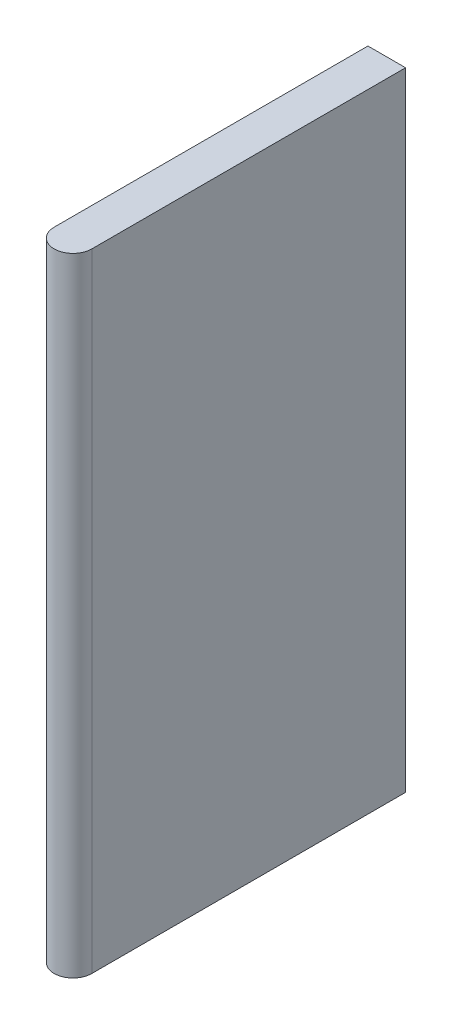
ISO-10303-21;
HEADER;
FILE_DESCRIPTION(('STEP AP214'),'2;1');
FILE_NAME('part.step','',(''),(''),'','','');
FILE_SCHEMA(('AUTOMOTIVE_DESIGN { 1 0 10303 214 1 1 1 1 }'));
ENDSEC;
DATA;
#1=APPLICATION_CONTEXT('core data for automotive mechanical design processes');
#2=APPLICATION_PROTOCOL_DEFINITION('international standard','automotive_design',2000,#1);
#3=PRODUCT_CONTEXT('',#1,'mechanical');
#4=PRODUCT('Part','Part','',(#3));
#5=PRODUCT_RELATED_PRODUCT_CATEGORY('part','',(#4));
#6=PRODUCT_DEFINITION_FORMATION('','',#4);
#7=PRODUCT_DEFINITION_CONTEXT('part definition',#1,'design');
#8=PRODUCT_DEFINITION('design','',#6,#7);
#9=PRODUCT_DEFINITION_SHAPE('','',#8);
#10=(LENGTH_UNIT() NAMED_UNIT(*) SI_UNIT(.MILLI.,.METRE.));
#11=(NAMED_UNIT(*) PLANE_ANGLE_UNIT() SI_UNIT($,.RADIAN.));
#12=(NAMED_UNIT(*) SI_UNIT($,.STERADIAN.) SOLID_ANGLE_UNIT());
#13=UNCERTAINTY_MEASURE_WITH_UNIT(LENGTH_MEASURE(1.E-05),#10,'distance_accuracy_value','');
#14=(GEOMETRIC_REPRESENTATION_CONTEXT(3) GLOBAL_UNCERTAINTY_ASSIGNED_CONTEXT((#13)) GLOBAL_UNIT_ASSIGNED_CONTEXT((#10,
#11,#12)) REPRESENTATION_CONTEXT('',''));
#15=CARTESIAN_POINT('',(0.,0.,0.));
#16=DIRECTION('',(0.,0.,1.));
#17=DIRECTION('',(1.,0.,0.));
#18=AXIS2_PLACEMENT_3D('',#15,#16,#17);
#19=CARTESIAN_POINT('',(0.381,12.7,3.175));
#20=DIRECTION('',(-1.,0.,0.));
#21=DIRECTION('',(0.,0.,1.));
#22=AXIS2_PLACEMENT_3D('',#19,#20,#21);
#23=PLANE('',#22);
#24=DIRECTION('',(0.,0.,-1.));
#25=VECTOR('',#24,1.);
#26=CARTESIAN_POINT('',(0.381,0.,3.175));
#27=LINE('',#26,#25);
#28=CARTESIAN_POINT('',(0.381,0.,3.175));
#29=VERTEX_POINT('',#28);
#30=CARTESIAN_POINT('',(0.381,0.,-3.175));
#31=VERTEX_POINT('',#30);
#32=EDGE_CURVE('E96',#29,#31,#27,.T.);
#33=ORIENTED_EDGE('',*,*,#32,.T.);
#34=DIRECTION('',(0.,-1.,0.));
#35=VECTOR('',#34,1.);
#36=CARTESIAN_POINT('',(0.381,12.7,-3.175));
#37=LINE('',#36,#35);
#38=CARTESIAN_POINT('',(0.381,12.7,-3.175));
#39=VERTEX_POINT('',#38);
#40=EDGE_CURVE('E11',#39,#31,#37,.T.);
#41=ORIENTED_EDGE('',*,*,#40,.F.);
#42=DIRECTION('',(0.,0.,-1.));
#43=VECTOR('',#42,1.);
#44=CARTESIAN_POINT('',(0.381,12.7,3.175));
#45=LINE('',#44,#43);
#46=CARTESIAN_POINT('',(0.381,12.7,3.175));
#47=VERTEX_POINT('',#46);
#48=EDGE_CURVE('E84',#47,#39,#45,.T.);
#49=ORIENTED_EDGE('',*,*,#48,.F.);
#50=DIRECTION('',(0.,-1.,0.));
#51=VECTOR('',#50,1.);
#52=CARTESIAN_POINT('',(0.381,12.7,3.175));
#53=LINE('',#52,#51);
#54=EDGE_CURVE('E92',#47,#29,#53,.T.);
#55=ORIENTED_EDGE('',*,*,#54,.T.);
#56=EDGE_LOOP('',(#33,#41,#49,#55));
#57=FACE_BOUND('',#56,.T.);
#58=ADVANCED_FACE('F33',(#57),#23,.F.);
#59=CARTESIAN_POINT('',(-0.381,12.7,-3.175));
#60=DIRECTION('',(0.,0.,1.));
#61=DIRECTION('',(1.,0.,0.));
#62=AXIS2_PLACEMENT_3D('',#59,#60,#61);
#63=PLANE('',#62);
#64=DIRECTION('',(-1.,0.,0.));
#65=VECTOR('',#64,1.);
#66=CARTESIAN_POINT('',(-0.381,0.,-3.175));
#67=LINE('',#66,#65);
#68=CARTESIAN_POINT('',(-0.381,0.,-3.175));
#69=VERTEX_POINT('',#68);
#70=EDGE_CURVE('E88',#31,#69,#67,.T.);
#71=ORIENTED_EDGE('',*,*,#70,.T.);
#72=DIRECTION('',(0.,-1.,0.));
#73=VECTOR('',#72,1.);
#74=CARTESIAN_POINT('',(-0.381,12.7,-3.175));
#75=LINE('',#74,#73);
#76=CARTESIAN_POINT('',(-0.381,12.7,-3.175));
#77=VERTEX_POINT('',#76);
#78=EDGE_CURVE('E41',#77,#69,#75,.T.);
#79=ORIENTED_EDGE('',*,*,#78,.F.);
#80=DIRECTION('',(-1.,0.,0.));
#81=VECTOR('',#80,1.);
#82=CARTESIAN_POINT('',(-0.381,12.7,-3.175));
#83=LINE('',#82,#81);
#84=EDGE_CURVE('E79',#39,#77,#83,.T.);
#85=ORIENTED_EDGE('',*,*,#84,.F.);
#86=ORIENTED_EDGE('',*,*,#40,.T.);
#87=EDGE_LOOP('',(#71,#79,#85,#86));
#88=FACE_BOUND('',#87,.T.);
#89=ADVANCED_FACE('F87',(#88),#63,.F.);
#90=CARTESIAN_POINT('',(-0.381,12.7,3.175));
#91=DIRECTION('',(1.,0.,0.));
#92=DIRECTION('',(0.,0.,-1.));
#93=AXIS2_PLACEMENT_3D('',#90,#91,#92);
#94=PLANE('',#93);
#95=DIRECTION('',(0.,0.,1.));
#96=VECTOR('',#95,1.);
#97=CARTESIAN_POINT('',(-0.381,0.,3.175));
#98=LINE('',#97,#96);
#99=CARTESIAN_POINT('',(-0.381,0.,3.175));
#100=VERTEX_POINT('',#99);
#101=EDGE_CURVE('E66',#69,#100,#98,.T.);
#102=ORIENTED_EDGE('',*,*,#101,.T.);
#103=DIRECTION('',(0.,-1.,0.));
#104=VECTOR('',#103,1.);
#105=CARTESIAN_POINT('',(-0.381,12.7,3.175));
#106=LINE('',#105,#104);
#107=CARTESIAN_POINT('',(-0.381,12.7,3.175));
#108=VERTEX_POINT('',#107);
#109=EDGE_CURVE('E89',#108,#100,#106,.T.);
#110=ORIENTED_EDGE('',*,*,#109,.F.);
#111=DIRECTION('',(0.,0.,1.));
#112=VECTOR('',#111,1.);
#113=CARTESIAN_POINT('',(-0.381,12.7,3.175));
#114=LINE('',#113,#112);
#115=EDGE_CURVE('E82',#77,#108,#114,.T.);
#116=ORIENTED_EDGE('',*,*,#115,.F.);
#117=ORIENTED_EDGE('',*,*,#78,.T.);
#118=EDGE_LOOP('',(#102,#110,#116,#117));
#119=FACE_BOUND('',#118,.T.);
#120=ADVANCED_FACE('F90',(#119),#94,.F.);
#121=CARTESIAN_POINT('',(0.,12.7,3.175));
#122=DIRECTION('',(0.,-1.,0.));
#123=DIRECTION('',(0.,0.,-1.));
#124=AXIS2_PLACEMENT_3D('',#121,#122,#123);
#125=CYLINDRICAL_SURFACE('',#124,0.381);
#126=CARTESIAN_POINT('',(0.,0.,3.175));
#127=DIRECTION('',(0.,1.,0.));
#128=DIRECTION('',(0.,0.,1.));
#129=AXIS2_PLACEMENT_3D('',#126,#127,#128);
#130=CIRCLE('',#129,0.381);
#131=EDGE_CURVE('E72',#100,#29,#130,.T.);
#132=ORIENTED_EDGE('',*,*,#131,.T.);
#133=ORIENTED_EDGE('',*,*,#54,.F.);
#134=CARTESIAN_POINT('',(0.,12.7,3.175));
#135=DIRECTION('',(0.,1.,0.));
#136=DIRECTION('',(0.,0.,1.));
#137=AXIS2_PLACEMENT_3D('',#134,#135,#136);
#138=CIRCLE('',#137,0.381);
#139=EDGE_CURVE('E49',#108,#47,#138,.T.);
#140=ORIENTED_EDGE('',*,*,#139,.F.);
#141=ORIENTED_EDGE('',*,*,#109,.T.);
#142=EDGE_LOOP('',(#132,#133,#140,#141));
#143=FACE_BOUND('',#142,.T.);
#144=ADVANCED_FACE('F103',(#143),#125,.T.);
#145=CARTESIAN_POINT('',(0.,12.7,3.175));
#146=DIRECTION('',(0.,1.,0.));
#147=DIRECTION('',(0.,0.,1.));
#148=AXIS2_PLACEMENT_3D('',#145,#146,#147);
#149=PLANE('',#148);
#150=ORIENTED_EDGE('',*,*,#48,.T.);
#151=ORIENTED_EDGE('',*,*,#84,.T.);
#152=ORIENTED_EDGE('',*,*,#115,.T.);
#153=ORIENTED_EDGE('',*,*,#139,.T.);
#154=EDGE_LOOP('',(#150,#151,#152,#153));
#155=FACE_BOUND('',#154,.T.);
#156=ADVANCED_FACE('F80',(#155),#149,.T.);
#157=CARTESIAN_POINT('',(0.,0.,3.175));
#158=DIRECTION('',(0.,1.,0.));
#159=DIRECTION('',(0.,0.,1.));
#160=AXIS2_PLACEMENT_3D('',#157,#158,#159);
#161=PLANE('',#160);
#162=ORIENTED_EDGE('',*,*,#32,.F.);
#163=ORIENTED_EDGE('',*,*,#131,.F.);
#164=ORIENTED_EDGE('',*,*,#101,.F.);
#165=ORIENTED_EDGE('',*,*,#70,.F.);
#166=EDGE_LOOP('',(#162,#163,#164,#165));
#167=FACE_BOUND('',#166,.T.);
#168=ADVANCED_FACE('F106',(#167),#161,.F.);
#169=CLOSED_SHELL('',(#58,#89,#120,#144,#156,#168));
#170=MANIFOLD_SOLID_BREP('B2',#169);
#171=ADVANCED_BREP_SHAPE_REPRESENTATION('',(#18,#170),#14);
#172=SHAPE_DEFINITION_REPRESENTATION(#9,#171);
ENDSEC;
END-ISO-10303-21;
